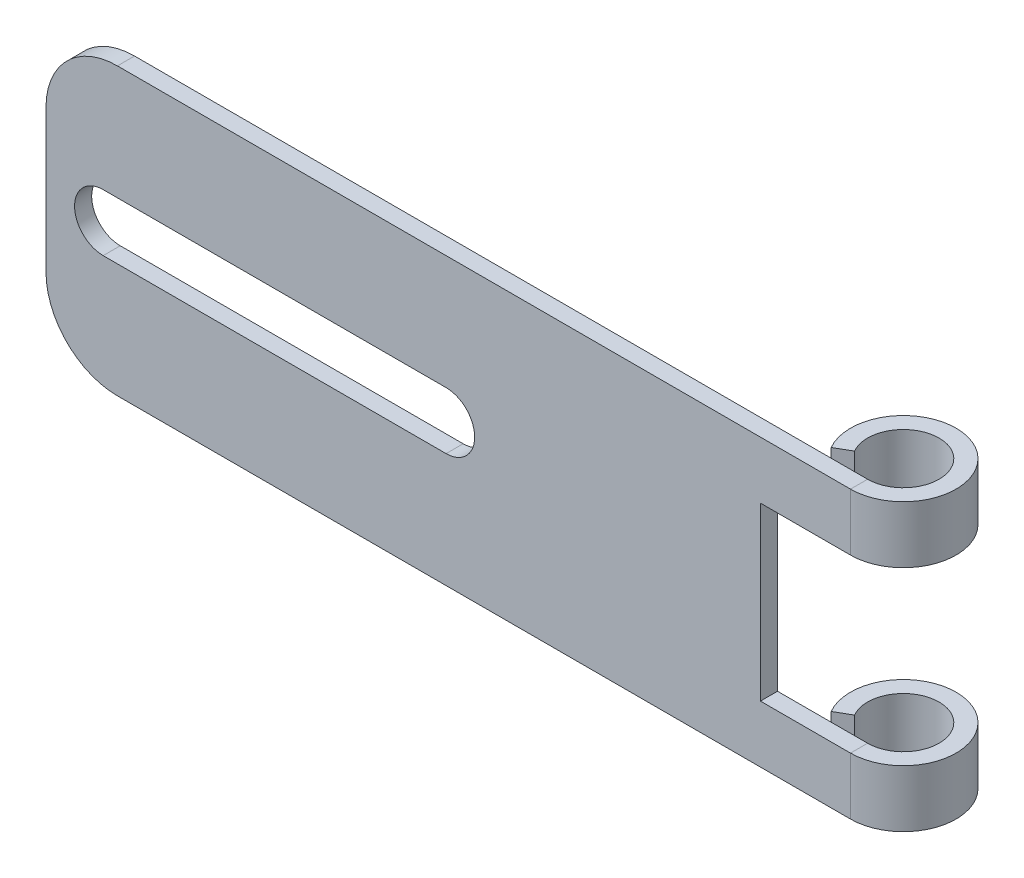
ISO-10303-21;
HEADER;
FILE_DESCRIPTION(('STEP AP214'),'2;1');
FILE_NAME('part.step','',(''),(''),'','','');
FILE_SCHEMA(('AUTOMOTIVE_DESIGN { 1 0 10303 214 1 1 1 1 }'));
ENDSEC;
DATA;
#1=APPLICATION_CONTEXT('core data for automotive mechanical design processes');
#2=APPLICATION_PROTOCOL_DEFINITION('international standard','automotive_design',2000,#1);
#3=PRODUCT_CONTEXT('',#1,'mechanical');
#4=PRODUCT('Part','Part','',(#3));
#5=PRODUCT_RELATED_PRODUCT_CATEGORY('part','',(#4));
#6=PRODUCT_DEFINITION_FORMATION('','',#4);
#7=PRODUCT_DEFINITION_CONTEXT('part definition',#1,'design');
#8=PRODUCT_DEFINITION('design','',#6,#7);
#9=PRODUCT_DEFINITION_SHAPE('','',#8);
#10=(LENGTH_UNIT() NAMED_UNIT(*) SI_UNIT(.MILLI.,.METRE.));
#11=(NAMED_UNIT(*) PLANE_ANGLE_UNIT() SI_UNIT($,.RADIAN.));
#12=(NAMED_UNIT(*) SI_UNIT($,.STERADIAN.) SOLID_ANGLE_UNIT());
#13=UNCERTAINTY_MEASURE_WITH_UNIT(LENGTH_MEASURE(1.E-05),#10,'distance_accuracy_value','');
#14=(GEOMETRIC_REPRESENTATION_CONTEXT(3) GLOBAL_UNCERTAINTY_ASSIGNED_CONTEXT((#13)) GLOBAL_UNIT_ASSIGNED_CONTEXT((#10,
#11,#12)) REPRESENTATION_CONTEXT('',''));
#15=CARTESIAN_POINT('',(0.,0.,0.));
#16=DIRECTION('',(0.,0.,1.));
#17=DIRECTION('',(1.,0.,0.));
#18=AXIS2_PLACEMENT_3D('',#15,#16,#17);
#19=CARTESIAN_POINT('',(38.1,-12.7,-1.51892));
#20=DIRECTION('',(0.,-1.,0.));
#21=DIRECTION('',(1.,0.,0.));
#22=AXIS2_PLACEMENT_3D('',#19,#20,#21);
#23=PLANE('',#22);
#24=DIRECTION('',(1.,0.,0.));
#25=VECTOR('',#24,1.);
#26=CARTESIAN_POINT('',(38.1,-12.7,-1.51892));
#27=LINE('',#26,#25);
#28=CARTESIAN_POINT('',(-31.75,-12.7,-1.51892));
#29=VERTEX_POINT('',#28);
#30=CARTESIAN_POINT('',(33.40608,-12.7,-1.51892));
#31=VERTEX_POINT('',#30);
#32=EDGE_CURVE('E352',#29,#31,#27,.T.);
#33=ORIENTED_EDGE('',*,*,#32,.T.);
#34=DIRECTION('',(0.,0.,1.));
#35=VECTOR('',#34,1.);
#36=CARTESIAN_POINT('',(33.40608,-12.7,-1.51892));
#37=LINE('',#36,#35);
#38=CARTESIAN_POINT('',(33.40608,-12.7,0.));
#39=VERTEX_POINT('',#38);
#40=EDGE_CURVE('E287',#31,#39,#37,.T.);
#41=ORIENTED_EDGE('',*,*,#40,.T.);
#42=DIRECTION('',(1.,0.,0.));
#43=VECTOR('',#42,1.);
#44=CARTESIAN_POINT('',(38.1,-12.7,0.));
#45=LINE('',#44,#43);
#46=CARTESIAN_POINT('',(-31.75,-12.7,0.));
#47=VERTEX_POINT('',#46);
#48=EDGE_CURVE('E369',#47,#39,#45,.T.);
#49=ORIENTED_EDGE('',*,*,#48,.F.);
#50=DIRECTION('',(0.,0.,1.));
#51=VECTOR('',#50,1.);
#52=CARTESIAN_POINT('',(-31.75,-12.7,-1.51892));
#53=LINE('',#52,#51);
#54=EDGE_CURVE('E243',#29,#47,#53,.T.);
#55=ORIENTED_EDGE('',*,*,#54,.F.);
#56=EDGE_LOOP('',(#33,#41,#49,#55));
#57=FACE_BOUND('',#56,.T.);
#58=ADVANCED_FACE('F44',(#57),#23,.T.);
#59=CARTESIAN_POINT('',(25.4,7.62,-1.51892));
#60=DIRECTION('',(0.,-1.,0.));
#61=DIRECTION('',(0.,0.,-1.));
#62=AXIS2_PLACEMENT_3D('',#59,#60,#61);
#63=PLANE('',#62);
#64=DIRECTION('',(1.,0.,0.));
#65=VECTOR('',#64,1.);
#66=CARTESIAN_POINT('',(25.4,7.62,-1.51892));
#67=LINE('',#66,#65);
#68=CARTESIAN_POINT('',(25.4,7.62,-1.51892));
#69=VERTEX_POINT('',#68);
#70=CARTESIAN_POINT('',(33.40608,7.62,-1.51892));
#71=VERTEX_POINT('',#70);
#72=EDGE_CURVE('E252',#69,#71,#67,.T.);
#73=ORIENTED_EDGE('',*,*,#72,.T.);
#74=DIRECTION('',(0.,0.,1.));
#75=VECTOR('',#74,1.);
#76=CARTESIAN_POINT('',(33.40608,7.62,-1.51892));
#77=LINE('',#76,#75);
#78=CARTESIAN_POINT('',(33.40608,7.62,0.));
#79=VERTEX_POINT('',#78);
#80=EDGE_CURVE('E235',#71,#79,#77,.T.);
#81=ORIENTED_EDGE('',*,*,#80,.T.);
#82=DIRECTION('',(1.,0.,0.));
#83=VECTOR('',#82,1.);
#84=CARTESIAN_POINT('',(25.4,7.62,0.));
#85=LINE('',#84,#83);
#86=CARTESIAN_POINT('',(25.4,7.62,0.));
#87=VERTEX_POINT('',#86);
#88=EDGE_CURVE('E230',#87,#79,#85,.T.);
#89=ORIENTED_EDGE('',*,*,#88,.F.);
#90=DIRECTION('',(0.,0.,1.));
#91=VECTOR('',#90,1.);
#92=CARTESIAN_POINT('',(25.4,7.62,-1.51892));
#93=LINE('',#92,#91);
#94=EDGE_CURVE('E213',#69,#87,#93,.T.);
#95=ORIENTED_EDGE('',*,*,#94,.F.);
#96=EDGE_LOOP('',(#73,#81,#89,#95));
#97=FACE_BOUND('',#96,.T.);
#98=ADVANCED_FACE('F233',(#97),#63,.T.);
#99=CARTESIAN_POINT('',(25.4,7.62,-1.51892));
#100=DIRECTION('',(1.,0.,0.));
#101=DIRECTION('',(0.,1.,0.));
#102=AXIS2_PLACEMENT_3D('',#99,#100,#101);
#103=PLANE('',#102);
#104=DIRECTION('',(0.,1.,0.));
#105=VECTOR('',#104,1.);
#106=CARTESIAN_POINT('',(25.4,7.62,0.));
#107=LINE('',#106,#105);
#108=CARTESIAN_POINT('',(25.4,-7.62,0.));
#109=VERTEX_POINT('',#108);
#110=EDGE_CURVE('E216',#109,#87,#107,.T.);
#111=ORIENTED_EDGE('',*,*,#110,.F.);
#112=DIRECTION('',(0.,0.,1.));
#113=VECTOR('',#112,1.);
#114=CARTESIAN_POINT('',(25.4,-7.62,-1.51892));
#115=LINE('',#114,#113);
#116=CARTESIAN_POINT('',(25.4,-7.62,-1.51892));
#117=VERTEX_POINT('',#116);
#118=EDGE_CURVE('E224',#117,#109,#115,.T.);
#119=ORIENTED_EDGE('',*,*,#118,.F.);
#120=DIRECTION('',(0.,1.,0.));
#121=VECTOR('',#120,1.);
#122=CARTESIAN_POINT('',(25.4,7.62,-1.51892));
#123=LINE('',#122,#121);
#124=EDGE_CURVE('E218',#117,#69,#123,.T.);
#125=ORIENTED_EDGE('',*,*,#124,.T.);
#126=ORIENTED_EDGE('',*,*,#94,.T.);
#127=EDGE_LOOP('',(#111,#119,#125,#126));
#128=FACE_BOUND('',#127,.T.);
#129=ADVANCED_FACE('F214',(#128),#103,.T.);
#130=CARTESIAN_POINT('',(25.4,-7.62,-1.51892));
#131=DIRECTION('',(0.,1.,0.));
#132=DIRECTION('',(-1.,0.,0.));
#133=AXIS2_PLACEMENT_3D('',#130,#131,#132);
#134=PLANE('',#133);
#135=DIRECTION('',(0.,0.,1.));
#136=VECTOR('',#135,1.);
#137=CARTESIAN_POINT('',(33.40608,-7.62,-1.51892));
#138=LINE('',#137,#136);
#139=CARTESIAN_POINT('',(33.40608,-7.62,-1.51892));
#140=VERTEX_POINT('',#139);
#141=CARTESIAN_POINT('',(33.40608,-7.62,0.));
#142=VERTEX_POINT('',#141);
#143=EDGE_CURVE('E304',#140,#142,#138,.T.);
#144=ORIENTED_EDGE('',*,*,#143,.F.);
#145=DIRECTION('',(-1.,0.,0.));
#146=VECTOR('',#145,1.);
#147=CARTESIAN_POINT('',(25.4,-7.62,-1.51892));
#148=LINE('',#147,#146);
#149=EDGE_CURVE('E355',#140,#117,#148,.T.);
#150=ORIENTED_EDGE('',*,*,#149,.T.);
#151=ORIENTED_EDGE('',*,*,#118,.T.);
#152=DIRECTION('',(-1.,0.,0.));
#153=VECTOR('',#152,1.);
#154=CARTESIAN_POINT('',(25.4,-7.62,0.));
#155=LINE('',#154,#153);
#156=EDGE_CURVE('E206',#142,#109,#155,.T.);
#157=ORIENTED_EDGE('',*,*,#156,.F.);
#158=EDGE_LOOP('',(#144,#150,#151,#157));
#159=FACE_BOUND('',#158,.T.);
#160=ADVANCED_FACE('F393',(#159),#134,.T.);
#161=CARTESIAN_POINT('',(-31.75,-6.35,-1.51892));
#162=DIRECTION('',(0.,0.,1.));
#163=DIRECTION('',(1.,0.,0.));
#164=AXIS2_PLACEMENT_3D('',#161,#162,#163);
#165=CYLINDRICAL_SURFACE('',#164,6.35);
#166=CARTESIAN_POINT('',(-31.75,-6.35,0.));
#167=DIRECTION('',(0.,0.,1.));
#168=DIRECTION('',(-1.,0.,0.));
#169=AXIS2_PLACEMENT_3D('',#166,#167,#168);
#170=CIRCLE('',#169,6.35);
#171=CARTESIAN_POINT('',(-38.1,-6.34999999999996,0.));
#172=VERTEX_POINT('',#171);
#173=EDGE_CURVE('E366',#172,#47,#170,.T.);
#174=ORIENTED_EDGE('',*,*,#173,.F.);
#175=DIRECTION('',(0.,0.,1.));
#176=VECTOR('',#175,1.);
#177=CARTESIAN_POINT('',(-38.1,-6.34999999999996,-1.51892));
#178=LINE('',#177,#176);
#179=CARTESIAN_POINT('',(-38.1,-6.34999999999996,-1.51892));
#180=VERTEX_POINT('',#179);
#181=EDGE_CURVE('E245',#180,#172,#178,.T.);
#182=ORIENTED_EDGE('',*,*,#181,.F.);
#183=CARTESIAN_POINT('',(-31.75,-6.35,-1.51892));
#184=DIRECTION('',(0.,0.,1.));
#185=DIRECTION('',(-1.,0.,0.));
#186=AXIS2_PLACEMENT_3D('',#183,#184,#185);
#187=CIRCLE('',#186,6.35);
#188=EDGE_CURVE('E349',#180,#29,#187,.T.);
#189=ORIENTED_EDGE('',*,*,#188,.T.);
#190=ORIENTED_EDGE('',*,*,#54,.T.);
#191=EDGE_LOOP('',(#174,#182,#189,#190));
#192=FACE_BOUND('',#191,.T.);
#193=ADVANCED_FACE('F426',(#192),#165,.T.);
#194=CARTESIAN_POINT('',(-38.1,6.34999999999995,-1.51892));
#195=DIRECTION('',(-1.,0.,0.));
#196=DIRECTION('',(0.,0.,1.));
#197=AXIS2_PLACEMENT_3D('',#194,#195,#196);
#198=PLANE('',#197);
#199=DIRECTION('',(0.,-1.,0.));
#200=VECTOR('',#199,1.);
#201=CARTESIAN_POINT('',(-38.1,6.34999999999995,0.));
#202=LINE('',#201,#200);
#203=CARTESIAN_POINT('',(-38.1,6.34999999999995,0.));
#204=VERTEX_POINT('',#203);
#205=EDGE_CURVE('E363',#204,#172,#202,.T.);
#206=ORIENTED_EDGE('',*,*,#205,.F.);
#207=DIRECTION('',(0.,0.,1.));
#208=VECTOR('',#207,1.);
#209=CARTESIAN_POINT('',(-38.1,6.34999999999995,-1.51892));
#210=LINE('',#209,#208);
#211=CARTESIAN_POINT('',(-38.1,6.34999999999995,-1.51892));
#212=VERTEX_POINT('',#211);
#213=EDGE_CURVE('E247',#212,#204,#210,.T.);
#214=ORIENTED_EDGE('',*,*,#213,.F.);
#215=DIRECTION('',(0.,-1.,0.));
#216=VECTOR('',#215,1.);
#217=CARTESIAN_POINT('',(-38.1,6.34999999999995,-1.51892));
#218=LINE('',#217,#216);
#219=EDGE_CURVE('E346',#212,#180,#218,.T.);
#220=ORIENTED_EDGE('',*,*,#219,.T.);
#221=ORIENTED_EDGE('',*,*,#181,.T.);
#222=EDGE_LOOP('',(#206,#214,#220,#221));
#223=FACE_BOUND('',#222,.T.);
#224=ADVANCED_FACE('F424',(#223),#198,.T.);
#225=CARTESIAN_POINT('',(-31.75,6.35,-1.51892));
#226=DIRECTION('',(0.,0.,1.));
#227=DIRECTION('',(1.,0.,0.));
#228=AXIS2_PLACEMENT_3D('',#225,#226,#227);
#229=CYLINDRICAL_SURFACE('',#228,6.35);
#230=CARTESIAN_POINT('',(-31.75,6.35,0.));
#231=DIRECTION('',(0.,0.,1.));
#232=DIRECTION('',(1.,0.,0.));
#233=AXIS2_PLACEMENT_3D('',#230,#231,#232);
#234=CIRCLE('',#233,6.35);
#235=CARTESIAN_POINT('',(-31.75,12.7,0.));
#236=VERTEX_POINT('',#235);
#237=EDGE_CURVE('E360',#236,#204,#234,.T.);
#238=ORIENTED_EDGE('',*,*,#237,.F.);
#239=DIRECTION('',(0.,0.,1.));
#240=VECTOR('',#239,1.);
#241=CARTESIAN_POINT('',(-31.75,12.7,-1.51892));
#242=LINE('',#241,#240);
#243=CARTESIAN_POINT('',(-31.75,12.7,-1.51892));
#244=VERTEX_POINT('',#243);
#245=EDGE_CURVE('E249',#244,#236,#242,.T.);
#246=ORIENTED_EDGE('',*,*,#245,.F.);
#247=CARTESIAN_POINT('',(-31.75,6.35,-1.51892));
#248=DIRECTION('',(0.,0.,1.));
#249=DIRECTION('',(1.,0.,0.));
#250=AXIS2_PLACEMENT_3D('',#247,#248,#249);
#251=CIRCLE('',#250,6.35);
#252=EDGE_CURVE('E238',#244,#212,#251,.T.);
#253=ORIENTED_EDGE('',*,*,#252,.T.);
#254=ORIENTED_EDGE('',*,*,#213,.T.);
#255=EDGE_LOOP('',(#238,#246,#253,#254));
#256=FACE_BOUND('',#255,.T.);
#257=ADVANCED_FACE('F421',(#256),#229,.T.);
#258=CARTESIAN_POINT('',(38.1,12.7,-1.51892));
#259=DIRECTION('',(0.,1.,0.));
#260=DIRECTION('',(-1.,0.,0.));
#261=AXIS2_PLACEMENT_3D('',#258,#259,#260);
#262=PLANE('',#261);
#263=DIRECTION('',(0.,0.,1.));
#264=VECTOR('',#263,1.);
#265=CARTESIAN_POINT('',(33.40608,12.7,-1.51892));
#266=LINE('',#265,#264);
#267=CARTESIAN_POINT('',(33.40608,12.7,-1.51892));
#268=VERTEX_POINT('',#267);
#269=CARTESIAN_POINT('',(33.40608,12.7,0.));
#270=VERTEX_POINT('',#269);
#271=EDGE_CURVE('E335',#268,#270,#266,.T.);
#272=ORIENTED_EDGE('',*,*,#271,.F.);
#273=DIRECTION('',(-1.,0.,0.));
#274=VECTOR('',#273,1.);
#275=CARTESIAN_POINT('',(38.1,12.7,-1.51892));
#276=LINE('',#275,#274);
#277=EDGE_CURVE('E236',#268,#244,#276,.T.);
#278=ORIENTED_EDGE('',*,*,#277,.T.);
#279=ORIENTED_EDGE('',*,*,#245,.T.);
#280=DIRECTION('',(-1.,0.,0.));
#281=VECTOR('',#280,1.);
#282=CARTESIAN_POINT('',(38.1,12.7,0.));
#283=LINE('',#282,#281);
#284=EDGE_CURVE('E342',#270,#236,#283,.T.);
#285=ORIENTED_EDGE('',*,*,#284,.F.);
#286=EDGE_LOOP('',(#272,#278,#279,#285));
#287=FACE_BOUND('',#286,.T.);
#288=ADVANCED_FACE('F46',(#287),#262,.T.);
#289=CARTESIAN_POINT('',(-31.75,-6.35,-1.51892));
#290=DIRECTION('',(0.,0.,-1.));
#291=DIRECTION('',(-1.,0.,0.));
#292=AXIS2_PLACEMENT_3D('',#289,#290,#291);
#293=PLANE('',#292);
#294=CARTESIAN_POINT('',(-33.02,0.,-1.51892));
#295=DIRECTION('',(0.,0.,-1.));
#296=DIRECTION('',(-1.,0.,0.));
#297=AXIS2_PLACEMENT_3D('',#294,#295,#296);
#298=CIRCLE('',#297,2.54000000000001);
#299=CARTESIAN_POINT('',(-33.02,-2.54000000000001,-1.51892));
#300=VERTEX_POINT('',#299);
#301=CARTESIAN_POINT('',(-33.02,2.54000000000001,-1.51892));
#302=VERTEX_POINT('',#301);
#303=EDGE_CURVE('E267',#300,#302,#298,.T.);
#304=ORIENTED_EDGE('',*,*,#303,.F.);
#305=DIRECTION('',(-1.,0.,0.));
#306=VECTOR('',#305,1.);
#307=CARTESIAN_POINT('',(-31.75,-2.54000000000001,-1.51892));
#308=LINE('',#307,#306);
#309=CARTESIAN_POINT('',(-2.54000000000001,-2.54,-1.51892));
#310=VERTEX_POINT('',#309);
#311=EDGE_CURVE('E268',#310,#300,#308,.T.);
#312=ORIENTED_EDGE('',*,*,#311,.F.);
#313=CARTESIAN_POINT('',(-2.54000000000001,0.,-1.51892));
#314=DIRECTION('',(0.,0.,-1.));
#315=DIRECTION('',(-1.,0.,0.));
#316=AXIS2_PLACEMENT_3D('',#313,#314,#315);
#317=CIRCLE('',#316,2.54000000000001);
#318=CARTESIAN_POINT('',(-2.54000000000001,2.54000000000001,-1.51892));
#319=VERTEX_POINT('',#318);
#320=EDGE_CURVE('E270',#319,#310,#317,.T.);
#321=ORIENTED_EDGE('',*,*,#320,.F.);
#322=DIRECTION('',(1.,0.,0.));
#323=VECTOR('',#322,1.);
#324=CARTESIAN_POINT('',(-31.75,2.54,-1.51892));
#325=LINE('',#324,#323);
#326=EDGE_CURVE('E95',#302,#319,#325,.T.);
#327=ORIENTED_EDGE('',*,*,#326,.F.);
#328=EDGE_LOOP('',(#304,#312,#321,#327));
#329=FACE_BOUND('',#328,.T.);
#330=DIRECTION('',(0.,-1.,0.));
#331=VECTOR('',#330,1.);
#332=CARTESIAN_POINT('',(33.40608,-12.7,-1.51892));
#333=LINE('',#332,#331);
#334=EDGE_CURVE('E296',#31,#140,#333,.F.);
#335=ORIENTED_EDGE('',*,*,#334,.F.);
#336=ORIENTED_EDGE('',*,*,#32,.F.);
#337=ORIENTED_EDGE('',*,*,#188,.F.);
#338=ORIENTED_EDGE('',*,*,#219,.F.);
#339=ORIENTED_EDGE('',*,*,#252,.F.);
#340=ORIENTED_EDGE('',*,*,#277,.F.);
#341=DIRECTION('',(0.,-1.,0.));
#342=VECTOR('',#341,1.);
#343=CARTESIAN_POINT('',(33.40608,7.62,-1.51892));
#344=LINE('',#343,#342);
#345=EDGE_CURVE('E327',#71,#268,#344,.F.);
#346=ORIENTED_EDGE('',*,*,#345,.F.);
#347=ORIENTED_EDGE('',*,*,#72,.F.);
#348=ORIENTED_EDGE('',*,*,#124,.F.);
#349=ORIENTED_EDGE('',*,*,#149,.F.);
#350=EDGE_LOOP('',(#335,#336,#337,#338,#339,#340,#346,#347,#348,#349));
#351=FACE_BOUND('',#350,.T.);
#352=ADVANCED_FACE('F395',(#329,#351),#293,.T.);
#353=CARTESIAN_POINT('',(-31.75,-6.35,0.));
#354=DIRECTION('',(0.,0.,-1.));
#355=DIRECTION('',(-1.,0.,0.));
#356=AXIS2_PLACEMENT_3D('',#353,#354,#355);
#357=PLANE('',#356);
#358=DIRECTION('',(-1.,0.,0.));
#359=VECTOR('',#358,1.);
#360=CARTESIAN_POINT('',(-31.75,-2.54,0.));
#361=LINE('',#360,#359);
#362=CARTESIAN_POINT('',(-2.54000000000001,-2.54,0.));
#363=VERTEX_POINT('',#362);
#364=CARTESIAN_POINT('',(-33.02,-2.54,0.));
#365=VERTEX_POINT('',#364);
#366=EDGE_CURVE('E223',#363,#365,#361,.T.);
#367=ORIENTED_EDGE('',*,*,#366,.T.);
#368=CARTESIAN_POINT('',(-33.02,0.,0.));
#369=DIRECTION('',(0.,0.,1.));
#370=DIRECTION('',(1.,0.,0.));
#371=AXIS2_PLACEMENT_3D('',#368,#369,#370);
#372=CIRCLE('',#371,2.54000000000001);
#373=CARTESIAN_POINT('',(-33.02,2.54000000000001,0.));
#374=VERTEX_POINT('',#373);
#375=EDGE_CURVE('E11',#365,#374,#372,.F.);
#376=ORIENTED_EDGE('',*,*,#375,.T.);
#377=DIRECTION('',(-1.,0.,0.));
#378=VECTOR('',#377,1.);
#379=CARTESIAN_POINT('',(-31.75,2.54,0.));
#380=LINE('',#379,#378);
#381=CARTESIAN_POINT('',(-2.54000000000001,2.54000000000001,0.));
#382=VERTEX_POINT('',#381);
#383=EDGE_CURVE('E53',#374,#382,#380,.F.);
#384=ORIENTED_EDGE('',*,*,#383,.T.);
#385=CARTESIAN_POINT('',(-2.54000000000001,0.,0.));
#386=DIRECTION('',(0.,0.,1.));
#387=DIRECTION('',(1.,0.,0.));
#388=AXIS2_PLACEMENT_3D('',#385,#386,#387);
#389=CIRCLE('',#388,2.54000000000001);
#390=EDGE_CURVE('E85',#382,#363,#389,.F.);
#391=ORIENTED_EDGE('',*,*,#390,.T.);
#392=EDGE_LOOP('',(#367,#376,#384,#391));
#393=FACE_BOUND('',#392,.T.);
#394=ORIENTED_EDGE('',*,*,#48,.T.);
#395=DIRECTION('',(0.,-1.,0.));
#396=VECTOR('',#395,1.);
#397=CARTESIAN_POINT('',(33.40608,-12.7,0.));
#398=LINE('',#397,#396);
#399=EDGE_CURVE('E281',#39,#142,#398,.F.);
#400=ORIENTED_EDGE('',*,*,#399,.T.);
#401=ORIENTED_EDGE('',*,*,#156,.T.);
#402=ORIENTED_EDGE('',*,*,#110,.T.);
#403=ORIENTED_EDGE('',*,*,#88,.T.);
#404=DIRECTION('',(0.,-1.,0.));
#405=VECTOR('',#404,1.);
#406=CARTESIAN_POINT('',(33.40608,7.62,0.));
#407=LINE('',#406,#405);
#408=EDGE_CURVE('E313',#79,#270,#407,.F.);
#409=ORIENTED_EDGE('',*,*,#408,.T.);
#410=ORIENTED_EDGE('',*,*,#284,.T.);
#411=ORIENTED_EDGE('',*,*,#237,.T.);
#412=ORIENTED_EDGE('',*,*,#205,.T.);
#413=ORIENTED_EDGE('',*,*,#173,.T.);
#414=EDGE_LOOP('',(#394,#400,#401,#402,#403,#409,#410,#411,#412,#413));
#415=FACE_BOUND('',#414,.T.);
#416=ADVANCED_FACE('F228',(#393,#415),#357,.F.);
#417=CARTESIAN_POINT('',(30.6564493429844,10.16,-3.10641999999997));
#418=DIRECTION('',(-0.50000000000001,0.,-0.866025403784433));
#419=DIRECTION('',(0.,-1.,0.));
#420=AXIS2_PLACEMENT_3D('',#417,#418,#419);
#421=PLANE('',#420);
#422=DIRECTION('',(-0.866025403784433,0.,0.50000000000001));
#423=VECTOR('',#422,1.);
#424=CARTESIAN_POINT('',(30.6564493429844,7.62,-3.10641999999997));
#425=LINE('',#424,#423);
#426=CARTESIAN_POINT('',(30.6564493429844,7.62,-3.10641999999997));
#427=VERTEX_POINT('',#426);
#428=CARTESIAN_POINT('',(29.3410260366682,7.62,-2.34695999999995));
#429=VERTEX_POINT('',#428);
#430=EDGE_CURVE('E340',#427,#429,#425,.T.);
#431=ORIENTED_EDGE('',*,*,#430,.F.);
#432=DIRECTION('',(0.,-1.,0.));
#433=VECTOR('',#432,1.);
#434=CARTESIAN_POINT('',(30.6564493429844,7.62,-3.10641999999997));
#435=LINE('',#434,#433);
#436=CARTESIAN_POINT('',(30.6564493429844,12.7,-3.10641999999997));
#437=VERTEX_POINT('',#436);
#438=EDGE_CURVE('E311',#437,#427,#435,.T.);
#439=ORIENTED_EDGE('',*,*,#438,.F.);
#440=DIRECTION('',(-0.866025403784433,0.,0.50000000000001));
#441=VECTOR('',#440,1.);
#442=CARTESIAN_POINT('',(30.6564493429844,12.7,-3.10641999999997));
#443=LINE('',#442,#441);
#444=CARTESIAN_POINT('',(29.3410260366682,12.7,-2.34695999999995));
#445=VERTEX_POINT('',#444);
#446=EDGE_CURVE('E338',#437,#445,#443,.T.);
#447=ORIENTED_EDGE('',*,*,#446,.T.);
#448=DIRECTION('',(0.,-1.,0.));
#449=VECTOR('',#448,1.);
#450=CARTESIAN_POINT('',(29.3410260366682,7.62,-2.34695999999995));
#451=LINE('',#450,#449);
#452=EDGE_CURVE('E319',#445,#429,#451,.T.);
#453=ORIENTED_EDGE('',*,*,#452,.T.);
#454=EDGE_LOOP('',(#431,#439,#447,#453));
#455=FACE_BOUND('',#454,.T.);
#456=ADVANCED_FACE('F407',(#455),#421,.F.);
#457=CARTESIAN_POINT('',(33.40608,12.7,-4.69392));
#458=DIRECTION('',(0.,1.,0.));
#459=DIRECTION('',(0.,0.,1.));
#460=AXIS2_PLACEMENT_3D('',#457,#458,#459);
#461=PLANE('',#460);
#462=ORIENTED_EDGE('',*,*,#446,.F.);
#463=CARTESIAN_POINT('',(33.40608,12.7,-4.69392));
#464=DIRECTION('',(0.,-1.,0.));
#465=DIRECTION('',(0.,0.,-1.));
#466=AXIS2_PLACEMENT_3D('',#463,#464,#465);
#467=CIRCLE('',#466,3.175);
#468=EDGE_CURVE('E322',#268,#437,#467,.F.);
#469=ORIENTED_EDGE('',*,*,#468,.F.);
#470=ORIENTED_EDGE('',*,*,#271,.T.);
#471=CARTESIAN_POINT('',(33.40608,12.7,-4.69392));
#472=DIRECTION('',(0.,-1.,0.));
#473=DIRECTION('',(0.,0.,-1.));
#474=AXIS2_PLACEMENT_3D('',#471,#472,#473);
#475=CIRCLE('',#474,4.69392);
#476=EDGE_CURVE('E315',#270,#445,#475,.F.);
#477=ORIENTED_EDGE('',*,*,#476,.T.);
#478=EDGE_LOOP('',(#462,#469,#470,#477));
#479=FACE_BOUND('',#478,.T.);
#480=ADVANCED_FACE('F413',(#479),#461,.T.);
#481=CARTESIAN_POINT('',(33.40608,7.62,-4.69392));
#482=DIRECTION('',(0.,1.,0.));
#483=DIRECTION('',(0.,0.,1.));
#484=AXIS2_PLACEMENT_3D('',#481,#482,#483);
#485=PLANE('',#484);
#486=CARTESIAN_POINT('',(33.40608,7.62,-4.69392));
#487=DIRECTION('',(0.,-1.,0.));
#488=DIRECTION('',(0.,0.,-1.));
#489=AXIS2_PLACEMENT_3D('',#486,#487,#488);
#490=CIRCLE('',#489,3.175);
#491=EDGE_CURVE('E330',#427,#71,#490,.T.);
#492=ORIENTED_EDGE('',*,*,#491,.F.);
#493=ORIENTED_EDGE('',*,*,#430,.T.);
#494=CARTESIAN_POINT('',(33.40608,7.62,-4.69392));
#495=DIRECTION('',(0.,-1.,0.));
#496=DIRECTION('',(0.,0.,-1.));
#497=AXIS2_PLACEMENT_3D('',#494,#495,#496);
#498=CIRCLE('',#497,4.69392);
#499=EDGE_CURVE('E316',#429,#79,#498,.T.);
#500=ORIENTED_EDGE('',*,*,#499,.T.);
#501=ORIENTED_EDGE('',*,*,#80,.F.);
#502=EDGE_LOOP('',(#492,#493,#500,#501));
#503=FACE_BOUND('',#502,.T.);
#504=ADVANCED_FACE('F400',(#503),#485,.F.);
#505=CARTESIAN_POINT('',(33.40608,7.62,-4.69392));
#506=DIRECTION('',(0.,-1.,0.));
#507=DIRECTION('',(-0.866025403784433,0.,0.50000000000001));
#508=AXIS2_PLACEMENT_3D('',#505,#506,#507);
#509=CYLINDRICAL_SURFACE('',#508,4.69392);
#510=ORIENTED_EDGE('',*,*,#408,.F.);
#511=ORIENTED_EDGE('',*,*,#499,.F.);
#512=ORIENTED_EDGE('',*,*,#452,.F.);
#513=ORIENTED_EDGE('',*,*,#476,.F.);
#514=EDGE_LOOP('',(#510,#511,#512,#513));
#515=FACE_BOUND('',#514,.T.);
#516=ADVANCED_FACE('F410',(#515),#509,.T.);
#517=CARTESIAN_POINT('',(33.40608,7.62,-4.69392));
#518=DIRECTION('',(0.,-1.,0.));
#519=DIRECTION('',(-0.866025403784433,0.,0.50000000000001));
#520=AXIS2_PLACEMENT_3D('',#517,#518,#519);
#521=CYLINDRICAL_SURFACE('',#520,3.175);
#522=ORIENTED_EDGE('',*,*,#345,.T.);
#523=ORIENTED_EDGE('',*,*,#468,.T.);
#524=ORIENTED_EDGE('',*,*,#438,.T.);
#525=ORIENTED_EDGE('',*,*,#491,.T.);
#526=EDGE_LOOP('',(#522,#523,#524,#525));
#527=FACE_BOUND('',#526,.T.);
#528=ADVANCED_FACE('F403',(#527),#521,.F.);
#529=CARTESIAN_POINT('',(30.6564493429844,-10.16,-3.10641999999997));
#530=DIRECTION('',(-0.500000000000011,0.,-0.866025403784432));
#531=DIRECTION('',(0.,-1.,0.));
#532=AXIS2_PLACEMENT_3D('',#529,#530,#531);
#533=PLANE('',#532);
#534=DIRECTION('',(-0.866025403784432,0.,0.500000000000011));
#535=VECTOR('',#534,1.);
#536=CARTESIAN_POINT('',(30.6564493429844,-12.7,-3.10641999999997));
#537=LINE('',#536,#535);
#538=CARTESIAN_POINT('',(30.6564493429844,-12.7,-3.10641999999997));
#539=VERTEX_POINT('',#538);
#540=CARTESIAN_POINT('',(29.3410260366682,-12.7,-2.34695999999995));
#541=VERTEX_POINT('',#540);
#542=EDGE_CURVE('E309',#539,#541,#537,.T.);
#543=ORIENTED_EDGE('',*,*,#542,.F.);
#544=DIRECTION('',(0.,-1.,0.));
#545=VECTOR('',#544,1.);
#546=CARTESIAN_POINT('',(30.6564493429844,-12.7,-3.10641999999997));
#547=LINE('',#546,#545);
#548=CARTESIAN_POINT('',(30.6564493429844,-7.62000000000001,-3.10641999999997));
#549=VERTEX_POINT('',#548);
#550=EDGE_CURVE('E280',#549,#539,#547,.T.);
#551=ORIENTED_EDGE('',*,*,#550,.F.);
#552=DIRECTION('',(-0.866025403784432,0.,0.500000000000011));
#553=VECTOR('',#552,1.);
#554=CARTESIAN_POINT('',(30.6564493429844,-7.62000000000001,-3.10641999999997));
#555=LINE('',#554,#553);
#556=CARTESIAN_POINT('',(29.3410260366682,-7.62000000000001,-2.34695999999995));
#557=VERTEX_POINT('',#556);
#558=EDGE_CURVE('E307',#549,#557,#555,.T.);
#559=ORIENTED_EDGE('',*,*,#558,.T.);
#560=DIRECTION('',(0.,-1.,0.));
#561=VECTOR('',#560,1.);
#562=CARTESIAN_POINT('',(29.3410260366682,-12.7,-2.34695999999995));
#563=LINE('',#562,#561);
#564=EDGE_CURVE('E288',#557,#541,#563,.T.);
#565=ORIENTED_EDGE('',*,*,#564,.T.);
#566=EDGE_LOOP('',(#543,#551,#559,#565));
#567=FACE_BOUND('',#566,.T.);
#568=ADVANCED_FACE('F385',(#567),#533,.F.);
#569=CARTESIAN_POINT('',(33.40608,-7.62,-4.69392));
#570=DIRECTION('',(0.,1.,0.));
#571=DIRECTION('',(-1.,0.,0.));
#572=AXIS2_PLACEMENT_3D('',#569,#570,#571);
#573=PLANE('',#572);
#574=ORIENTED_EDGE('',*,*,#558,.F.);
#575=CARTESIAN_POINT('',(33.40608,-7.62,-4.69392));
#576=DIRECTION('',(0.,-1.,0.));
#577=DIRECTION('',(1.,0.,0.));
#578=AXIS2_PLACEMENT_3D('',#575,#576,#577);
#579=CIRCLE('',#578,3.175);
#580=EDGE_CURVE('E291',#140,#549,#579,.F.);
#581=ORIENTED_EDGE('',*,*,#580,.F.);
#582=ORIENTED_EDGE('',*,*,#143,.T.);
#583=CARTESIAN_POINT('',(33.40608,-7.62,-4.69392));
#584=DIRECTION('',(0.,-1.,0.));
#585=DIRECTION('',(1.,0.,0.));
#586=AXIS2_PLACEMENT_3D('',#583,#584,#585);
#587=CIRCLE('',#586,4.69392);
#588=EDGE_CURVE('E283',#142,#557,#587,.F.);
#589=ORIENTED_EDGE('',*,*,#588,.T.);
#590=EDGE_LOOP('',(#574,#581,#582,#589));
#591=FACE_BOUND('',#590,.T.);
#592=ADVANCED_FACE('F390',(#591),#573,.T.);
#593=CARTESIAN_POINT('',(33.40608,-12.7,-4.69392));
#594=DIRECTION('',(0.,1.,0.));
#595=DIRECTION('',(-1.,0.,0.));
#596=AXIS2_PLACEMENT_3D('',#593,#594,#595);
#597=PLANE('',#596);
#598=CARTESIAN_POINT('',(33.40608,-12.7,-4.69392));
#599=DIRECTION('',(0.,-1.,0.));
#600=DIRECTION('',(1.,0.,0.));
#601=AXIS2_PLACEMENT_3D('',#598,#599,#600);
#602=CIRCLE('',#601,3.175);
#603=EDGE_CURVE('E299',#539,#31,#602,.T.);
#604=ORIENTED_EDGE('',*,*,#603,.F.);
#605=ORIENTED_EDGE('',*,*,#542,.T.);
#606=CARTESIAN_POINT('',(33.40608,-12.7,-4.69392));
#607=DIRECTION('',(0.,-1.,0.));
#608=DIRECTION('',(1.,0.,0.));
#609=AXIS2_PLACEMENT_3D('',#606,#607,#608);
#610=CIRCLE('',#609,4.69392);
#611=EDGE_CURVE('E284',#541,#39,#610,.T.);
#612=ORIENTED_EDGE('',*,*,#611,.T.);
#613=ORIENTED_EDGE('',*,*,#40,.F.);
#614=EDGE_LOOP('',(#604,#605,#612,#613));
#615=FACE_BOUND('',#614,.T.);
#616=ADVANCED_FACE('F382',(#615),#597,.F.);
#617=CARTESIAN_POINT('',(33.40608,-12.7,-4.69392));
#618=DIRECTION('',(0.,-1.,0.));
#619=DIRECTION('',(-0.866025403784433,0.,0.500000000000011));
#620=AXIS2_PLACEMENT_3D('',#617,#618,#619);
#621=CYLINDRICAL_SURFACE('',#620,4.69392);
#622=ORIENTED_EDGE('',*,*,#399,.F.);
#623=ORIENTED_EDGE('',*,*,#611,.F.);
#624=ORIENTED_EDGE('',*,*,#564,.F.);
#625=ORIENTED_EDGE('',*,*,#588,.F.);
#626=EDGE_LOOP('',(#622,#623,#624,#625));
#627=FACE_BOUND('',#626,.T.);
#628=ADVANCED_FACE('F377',(#627),#621,.T.);
#629=CARTESIAN_POINT('',(33.40608,-12.7,-4.69392));
#630=DIRECTION('',(0.,-1.,0.));
#631=DIRECTION('',(-0.866025403784433,0.,0.500000000000011));
#632=AXIS2_PLACEMENT_3D('',#629,#630,#631);
#633=CYLINDRICAL_SURFACE('',#632,3.175);
#634=ORIENTED_EDGE('',*,*,#334,.T.);
#635=ORIENTED_EDGE('',*,*,#580,.T.);
#636=ORIENTED_EDGE('',*,*,#550,.T.);
#637=ORIENTED_EDGE('',*,*,#603,.T.);
#638=EDGE_LOOP('',(#634,#635,#636,#637));
#639=FACE_BOUND('',#638,.T.);
#640=ADVANCED_FACE('F387',(#639),#633,.F.);
#641=CARTESIAN_POINT('',(-33.02,0.,-9.38784));
#642=DIRECTION('',(0.,0.,1.));
#643=DIRECTION('',(1.,0.,0.));
#644=AXIS2_PLACEMENT_3D('',#641,#642,#643);
#645=CYLINDRICAL_SURFACE('',#644,2.54000000000001);
#646=ORIENTED_EDGE('',*,*,#303,.T.);
#647=DIRECTION('',(0.,0.,1.));
#648=VECTOR('',#647,1.);
#649=CARTESIAN_POINT('',(-33.02,2.54000000000001,-9.38784));
#650=LINE('',#649,#648);
#651=EDGE_CURVE('E261',#302,#374,#650,.T.);
#652=ORIENTED_EDGE('',*,*,#651,.T.);
#653=ORIENTED_EDGE('',*,*,#375,.F.);
#654=DIRECTION('',(0.,0.,1.));
#655=VECTOR('',#654,1.);
#656=CARTESIAN_POINT('',(-33.02,-2.54000000000001,-9.38784));
#657=LINE('',#656,#655);
#658=EDGE_CURVE('E274',#300,#365,#657,.T.);
#659=ORIENTED_EDGE('',*,*,#658,.F.);
#660=EDGE_LOOP('',(#646,#652,#653,#659));
#661=FACE_BOUND('',#660,.T.);
#662=ADVANCED_FACE('F264',(#661),#645,.F.);
#663=CARTESIAN_POINT('',(-33.02,2.54000000000001,-9.38784));
#664=DIRECTION('',(0.,1.,0.));
#665=DIRECTION('',(-1.,0.,0.));
#666=AXIS2_PLACEMENT_3D('',#663,#664,#665);
#667=PLANE('',#666);
#668=ORIENTED_EDGE('',*,*,#326,.T.);
#669=DIRECTION('',(0.,0.,1.));
#670=VECTOR('',#669,1.);
#671=CARTESIAN_POINT('',(-2.54000000000001,2.54000000000001,-9.38784));
#672=LINE('',#671,#670);
#673=EDGE_CURVE('E262',#319,#382,#672,.T.);
#674=ORIENTED_EDGE('',*,*,#673,.T.);
#675=ORIENTED_EDGE('',*,*,#383,.F.);
#676=ORIENTED_EDGE('',*,*,#651,.F.);
#677=EDGE_LOOP('',(#668,#674,#675,#676));
#678=FACE_BOUND('',#677,.T.);
#679=ADVANCED_FACE('F260',(#678),#667,.F.);
#680=CARTESIAN_POINT('',(-2.54000000000001,0.,-9.38784));
#681=DIRECTION('',(0.,0.,1.));
#682=DIRECTION('',(1.,0.,0.));
#683=AXIS2_PLACEMENT_3D('',#680,#681,#682);
#684=CYLINDRICAL_SURFACE('',#683,2.54000000000001);
#685=ORIENTED_EDGE('',*,*,#320,.T.);
#686=DIRECTION('',(0.,0.,1.));
#687=VECTOR('',#686,1.);
#688=CARTESIAN_POINT('',(-2.54000000000001,-2.54,-9.38784));
#689=LINE('',#688,#687);
#690=EDGE_CURVE('E63',#310,#363,#689,.T.);
#691=ORIENTED_EDGE('',*,*,#690,.T.);
#692=ORIENTED_EDGE('',*,*,#390,.F.);
#693=ORIENTED_EDGE('',*,*,#673,.F.);
#694=EDGE_LOOP('',(#685,#691,#692,#693));
#695=FACE_BOUND('',#694,.T.);
#696=ADVANCED_FACE('F596',(#695),#684,.F.);
#697=CARTESIAN_POINT('',(-33.02,-2.54000000000001,-9.38784));
#698=DIRECTION('',(0.,-1.,0.));
#699=DIRECTION('',(1.,0.,0.));
#700=AXIS2_PLACEMENT_3D('',#697,#698,#699);
#701=PLANE('',#700);
#702=ORIENTED_EDGE('',*,*,#311,.T.);
#703=ORIENTED_EDGE('',*,*,#658,.T.);
#704=ORIENTED_EDGE('',*,*,#366,.F.);
#705=ORIENTED_EDGE('',*,*,#690,.F.);
#706=EDGE_LOOP('',(#702,#703,#704,#705));
#707=FACE_BOUND('',#706,.T.);
#708=ADVANCED_FACE('F606',(#707),#701,.F.);
#709=CLOSED_SHELL('',(#58,#98,#129,#160,#193,#224,#257,#288,#352,#416,#456,#480,#504,#516,#528,
#568,#592,#616,#628,#640,#662,#679,#696,#708));
#710=MANIFOLD_SOLID_BREP('B2',#709);
#711=ADVANCED_BREP_SHAPE_REPRESENTATION('',(#18,#710),#14);
#712=SHAPE_DEFINITION_REPRESENTATION(#9,#711);
ENDSEC;
END-ISO-10303-21;
